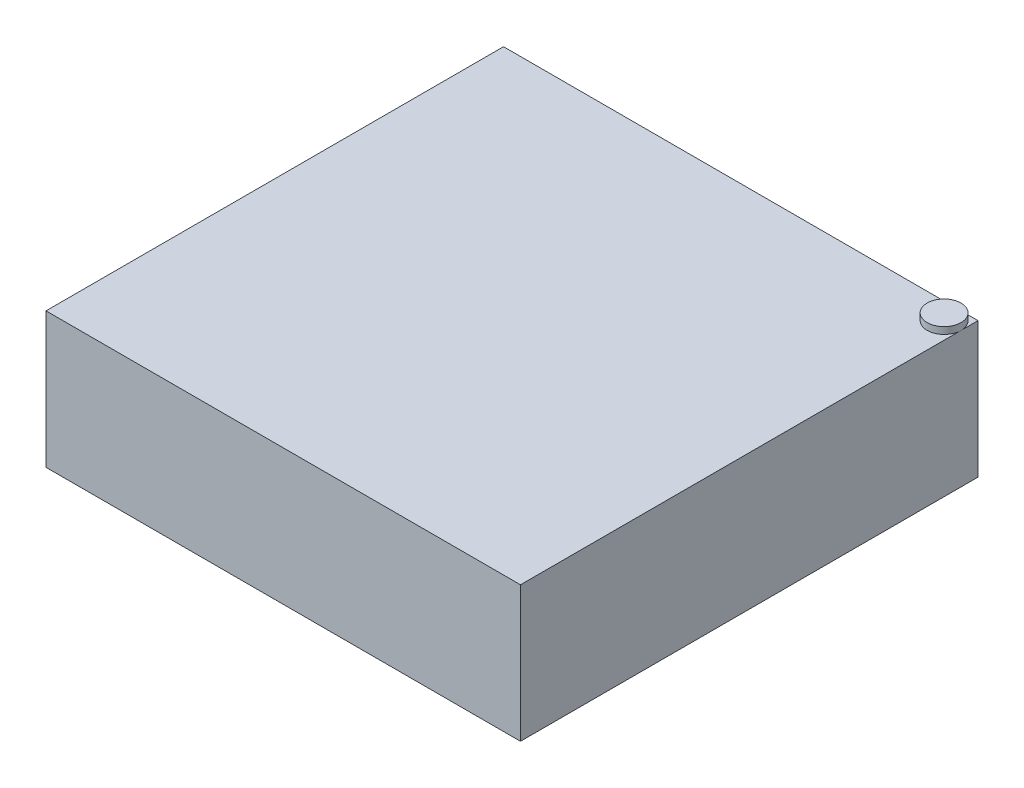
ISO-10303-21;
HEADER;
FILE_DESCRIPTION(('STEP AP214'),'2;1');
FILE_NAME('part.step','',(''),(''),'','','');
FILE_SCHEMA(('AUTOMOTIVE_DESIGN { 1 0 10303 214 1 1 1 1 }'));
ENDSEC;
DATA;
#1=APPLICATION_CONTEXT('core data for automotive mechanical design processes');
#2=APPLICATION_PROTOCOL_DEFINITION('international standard','automotive_design',2000,#1);
#3=PRODUCT_CONTEXT('',#1,'mechanical');
#4=PRODUCT('Part','Part','',(#3));
#5=PRODUCT_RELATED_PRODUCT_CATEGORY('part','',(#4));
#6=PRODUCT_DEFINITION_FORMATION('','',#4);
#7=PRODUCT_DEFINITION_CONTEXT('part definition',#1,'design');
#8=PRODUCT_DEFINITION('design','',#6,#7);
#9=PRODUCT_DEFINITION_SHAPE('','',#8);
#10=(LENGTH_UNIT() NAMED_UNIT(*) SI_UNIT(.MILLI.,.METRE.));
#11=(NAMED_UNIT(*) PLANE_ANGLE_UNIT() SI_UNIT($,.RADIAN.));
#12=(NAMED_UNIT(*) SI_UNIT($,.STERADIAN.) SOLID_ANGLE_UNIT());
#13=UNCERTAINTY_MEASURE_WITH_UNIT(LENGTH_MEASURE(1.E-05),#10,'distance_accuracy_value','');
#14=(GEOMETRIC_REPRESENTATION_CONTEXT(3) GLOBAL_UNCERTAINTY_ASSIGNED_CONTEXT((#13)) GLOBAL_UNIT_ASSIGNED_CONTEXT((#10,
#11,#12)) REPRESENTATION_CONTEXT('',''));
#15=CARTESIAN_POINT('',(0.,0.,0.));
#16=DIRECTION('',(0.,0.,1.));
#17=DIRECTION('',(1.,0.,0.));
#18=AXIS2_PLACEMENT_3D('',#15,#16,#17);
#19=CARTESIAN_POINT('',(0.,50.8,0.));
#20=DIRECTION('',(0.,-1.,0.));
#21=DIRECTION('',(0.,0.,-1.));
#22=AXIS2_PLACEMENT_3D('',#19,#20,#21);
#23=PLANE('',#22);
#24=CARTESIAN_POINT('',(82.55,50.8,-79.375));
#25=DIRECTION('',(0.,1.,0.));
#26=DIRECTION('',(0.,0.,1.));
#27=AXIS2_PLACEMENT_3D('',#24,#25,#26);
#28=CIRCLE('',#27,6.34999999999999);
#29=CARTESIAN_POINT('',(88.9,50.8,-79.375));
#30=VERTEX_POINT('',#29);
#31=CARTESIAN_POINT('',(82.55,50.8,-85.725));
#32=VERTEX_POINT('',#31);
#33=EDGE_CURVE('E50',#30,#32,#28,.T.);
#34=ORIENTED_EDGE('',*,*,#33,.F.);
#35=DIRECTION('',(0.,0.,-1.));
#36=VECTOR('',#35,1.);
#37=CARTESIAN_POINT('',(88.9,50.8,85.725));
#38=LINE('',#37,#36);
#39=CARTESIAN_POINT('',(88.9,50.8,-85.725));
#40=VERTEX_POINT('',#39);
#41=EDGE_CURVE('E96',#30,#40,#38,.T.);
#42=ORIENTED_EDGE('',*,*,#41,.T.);
#43=DIRECTION('',(-1.,0.,0.));
#44=VECTOR('',#43,1.);
#45=CARTESIAN_POINT('',(-88.9,50.8,-85.725));
#46=LINE('',#45,#44);
#47=EDGE_CURVE('E111',#40,#32,#46,.T.);
#48=ORIENTED_EDGE('',*,*,#47,.T.);
#49=EDGE_LOOP('',(#34,#42,#48));
#50=FACE_BOUND('',#49,.T.);
#51=ADVANCED_FACE('F39',(#50),#23,.F.);
#52=CARTESIAN_POINT('',(88.9,50.8,85.725));
#53=DIRECTION('',(-1.,0.,0.));
#54=DIRECTION('',(0.,0.,1.));
#55=AXIS2_PLACEMENT_3D('',#52,#53,#54);
#56=PLANE('',#55);
#57=DIRECTION('',(0.,0.,-1.));
#58=VECTOR('',#57,1.);
#59=CARTESIAN_POINT('',(88.9,0.,85.725));
#60=LINE('',#59,#58);
#61=CARTESIAN_POINT('',(88.9,0.,85.725));
#62=VERTEX_POINT('',#61);
#63=CARTESIAN_POINT('',(88.9,0.,-85.725));
#64=VERTEX_POINT('',#63);
#65=EDGE_CURVE('E161',#62,#64,#60,.T.);
#66=ORIENTED_EDGE('',*,*,#65,.T.);
#67=DIRECTION('',(0.,-1.,0.));
#68=VECTOR('',#67,1.);
#69=CARTESIAN_POINT('',(88.9,50.8,-85.725));
#70=LINE('',#69,#68);
#71=EDGE_CURVE('E43',#40,#64,#70,.T.);
#72=ORIENTED_EDGE('',*,*,#71,.F.);
#73=ORIENTED_EDGE('',*,*,#41,.F.);
#74=CARTESIAN_POINT('',(88.9,50.8,85.725));
#75=VERTEX_POINT('',#74);
#76=EDGE_CURVE('E100',#75,#30,#38,.T.);
#77=ORIENTED_EDGE('',*,*,#76,.F.);
#78=DIRECTION('',(0.,-1.,0.));
#79=VECTOR('',#78,1.);
#80=CARTESIAN_POINT('',(88.9,50.8,85.725));
#81=LINE('',#80,#79);
#82=EDGE_CURVE('E174',#75,#62,#81,.T.);
#83=ORIENTED_EDGE('',*,*,#82,.T.);
#84=EDGE_LOOP('',(#66,#72,#73,#77,#83));
#85=FACE_BOUND('',#84,.T.);
#86=ADVANCED_FACE('F41',(#85),#56,.F.);
#87=CARTESIAN_POINT('',(-88.9,50.8,-85.725));
#88=DIRECTION('',(0.,0.,1.));
#89=DIRECTION('',(1.,0.,0.));
#90=AXIS2_PLACEMENT_3D('',#87,#88,#89);
#91=PLANE('',#90);
#92=DIRECTION('',(-1.,0.,0.));
#93=VECTOR('',#92,1.);
#94=CARTESIAN_POINT('',(-88.9,0.,-85.725));
#95=LINE('',#94,#93);
#96=CARTESIAN_POINT('',(-88.9,0.,-85.725));
#97=VERTEX_POINT('',#96);
#98=EDGE_CURVE('E153',#64,#97,#95,.T.);
#99=ORIENTED_EDGE('',*,*,#98,.T.);
#100=DIRECTION('',(0.,-1.,0.));
#101=VECTOR('',#100,1.);
#102=CARTESIAN_POINT('',(-88.9,50.8,-85.725));
#103=LINE('',#102,#101);
#104=CARTESIAN_POINT('',(-88.9,50.8,-85.725));
#105=VERTEX_POINT('',#104);
#106=EDGE_CURVE('E155',#105,#97,#103,.T.);
#107=ORIENTED_EDGE('',*,*,#106,.F.);
#108=EDGE_CURVE('E104',#32,#105,#46,.T.);
#109=ORIENTED_EDGE('',*,*,#108,.F.);
#110=ORIENTED_EDGE('',*,*,#47,.F.);
#111=ORIENTED_EDGE('',*,*,#71,.T.);
#112=EDGE_LOOP('',(#99,#107,#109,#110,#111));
#113=FACE_BOUND('',#112,.T.);
#114=ADVANCED_FACE('F135',(#113),#91,.F.);
#115=CARTESIAN_POINT('',(-88.9,50.8,85.725));
#116=DIRECTION('',(1.,0.,0.));
#117=DIRECTION('',(0.,0.,-1.));
#118=AXIS2_PLACEMENT_3D('',#115,#116,#117);
#119=PLANE('',#118);
#120=DIRECTION('',(0.,0.,1.));
#121=VECTOR('',#120,1.);
#122=CARTESIAN_POINT('',(-88.9,0.,85.725));
#123=LINE('',#122,#121);
#124=CARTESIAN_POINT('',(-88.9,0.,85.725));
#125=VERTEX_POINT('',#124);
#126=EDGE_CURVE('E160',#97,#125,#123,.T.);
#127=ORIENTED_EDGE('',*,*,#126,.T.);
#128=DIRECTION('',(0.,-1.,0.));
#129=VECTOR('',#128,1.);
#130=CARTESIAN_POINT('',(-88.9,50.8,85.725));
#131=LINE('',#130,#129);
#132=CARTESIAN_POINT('',(-88.9,50.8,85.725));
#133=VERTEX_POINT('',#132);
#134=EDGE_CURVE('E165',#133,#125,#131,.T.);
#135=ORIENTED_EDGE('',*,*,#134,.F.);
#136=DIRECTION('',(0.,0.,1.));
#137=VECTOR('',#136,1.);
#138=CARTESIAN_POINT('',(-88.9,50.8,85.725));
#139=LINE('',#138,#137);
#140=EDGE_CURVE('E164',#105,#133,#139,.T.);
#141=ORIENTED_EDGE('',*,*,#140,.F.);
#142=ORIENTED_EDGE('',*,*,#106,.T.);
#143=EDGE_LOOP('',(#127,#135,#141,#142));
#144=FACE_BOUND('',#143,.T.);
#145=ADVANCED_FACE('F141',(#144),#119,.F.);
#146=CARTESIAN_POINT('',(-88.9,50.8,85.725));
#147=DIRECTION('',(0.,0.,-1.));
#148=DIRECTION('',(-1.,0.,0.));
#149=AXIS2_PLACEMENT_3D('',#146,#147,#148);
#150=PLANE('',#149);
#151=DIRECTION('',(1.,0.,0.));
#152=VECTOR('',#151,1.);
#153=CARTESIAN_POINT('',(-88.9,0.,85.725));
#154=LINE('',#153,#152);
#155=EDGE_CURVE('E88',#125,#62,#154,.T.);
#156=ORIENTED_EDGE('',*,*,#155,.T.);
#157=ORIENTED_EDGE('',*,*,#82,.F.);
#158=DIRECTION('',(1.,0.,0.));
#159=VECTOR('',#158,1.);
#160=CARTESIAN_POINT('',(-88.9,50.8,85.725));
#161=LINE('',#160,#159);
#162=EDGE_CURVE('E67',#133,#75,#161,.T.);
#163=ORIENTED_EDGE('',*,*,#162,.F.);
#164=ORIENTED_EDGE('',*,*,#134,.T.);
#165=EDGE_LOOP('',(#156,#157,#163,#164));
#166=FACE_BOUND('',#165,.T.);
#167=ADVANCED_FACE('F137',(#166),#150,.F.);
#168=EDGE_CURVE('E11',#32,#30,#28,.T.);
#169=ORIENTED_EDGE('',*,*,#168,.F.);
#170=ORIENTED_EDGE('',*,*,#108,.T.);
#171=ORIENTED_EDGE('',*,*,#140,.T.);
#172=ORIENTED_EDGE('',*,*,#162,.T.);
#173=ORIENTED_EDGE('',*,*,#76,.T.);
#174=EDGE_LOOP('',(#169,#170,#171,#172,#173));
#175=FACE_BOUND('',#174,.T.);
#176=ADVANCED_FACE('F101',(#175),#23,.F.);
#177=CARTESIAN_POINT('',(0.,0.,0.));
#178=DIRECTION('',(0.,-1.,0.));
#179=DIRECTION('',(0.,0.,-1.));
#180=AXIS2_PLACEMENT_3D('',#177,#178,#179);
#181=PLANE('',#180);
#182=ORIENTED_EDGE('',*,*,#65,.F.);
#183=ORIENTED_EDGE('',*,*,#155,.F.);
#184=ORIENTED_EDGE('',*,*,#126,.F.);
#185=ORIENTED_EDGE('',*,*,#98,.F.);
#186=EDGE_LOOP('',(#182,#183,#184,#185));
#187=FACE_BOUND('',#186,.T.);
#188=ADVANCED_FACE('F118',(#187),#181,.T.);
#189=CARTESIAN_POINT('',(82.55,53.34,-79.375));
#190=DIRECTION('',(0.,-1.,0.));
#191=DIRECTION('',(0.,0.,-1.));
#192=AXIS2_PLACEMENT_3D('',#189,#190,#191);
#193=CYLINDRICAL_SURFACE('',#192,6.34999999999999);
#194=CARTESIAN_POINT('',(82.55,53.34,-79.375));
#195=DIRECTION('',(0.,1.,0.));
#196=DIRECTION('',(0.,0.,1.));
#197=AXIS2_PLACEMENT_3D('',#194,#195,#196);
#198=CIRCLE('',#197,6.34999999999999);
#199=CARTESIAN_POINT('',(82.55,53.34,-73.025));
#200=VERTEX_POINT('',#199);
#201=EDGE_CURVE('E114',#200,#200,#198,.T.);
#202=ORIENTED_EDGE('',*,*,#201,.F.);
#203=EDGE_LOOP('',(#202));
#204=FACE_BOUND('',#203,.T.);
#205=ORIENTED_EDGE('',*,*,#33,.T.);
#206=ORIENTED_EDGE('',*,*,#168,.T.);
#207=EDGE_LOOP('',(#205,#206));
#208=FACE_BOUND('',#207,.T.);
#209=ADVANCED_FACE('F115',(#204,#208),#193,.T.);
#210=CARTESIAN_POINT('',(82.55,53.34,-79.375));
#211=DIRECTION('',(0.,1.,0.));
#212=DIRECTION('',(0.,0.,1.));
#213=AXIS2_PLACEMENT_3D('',#210,#211,#212);
#214=PLANE('',#213);
#215=ORIENTED_EDGE('',*,*,#201,.T.);
#216=EDGE_LOOP('',(#215));
#217=FACE_BOUND('',#216,.T.);
#218=ADVANCED_FACE('F117',(#217),#214,.T.);
#219=CLOSED_SHELL('',(#51,#86,#114,#145,#167,#176,#188,#209,#218));
#220=MANIFOLD_SOLID_BREP('B2',#219);
#221=ADVANCED_BREP_SHAPE_REPRESENTATION('',(#18,#220),#14);
#222=SHAPE_DEFINITION_REPRESENTATION(#9,#221);
ENDSEC;
END-ISO-10303-21;
